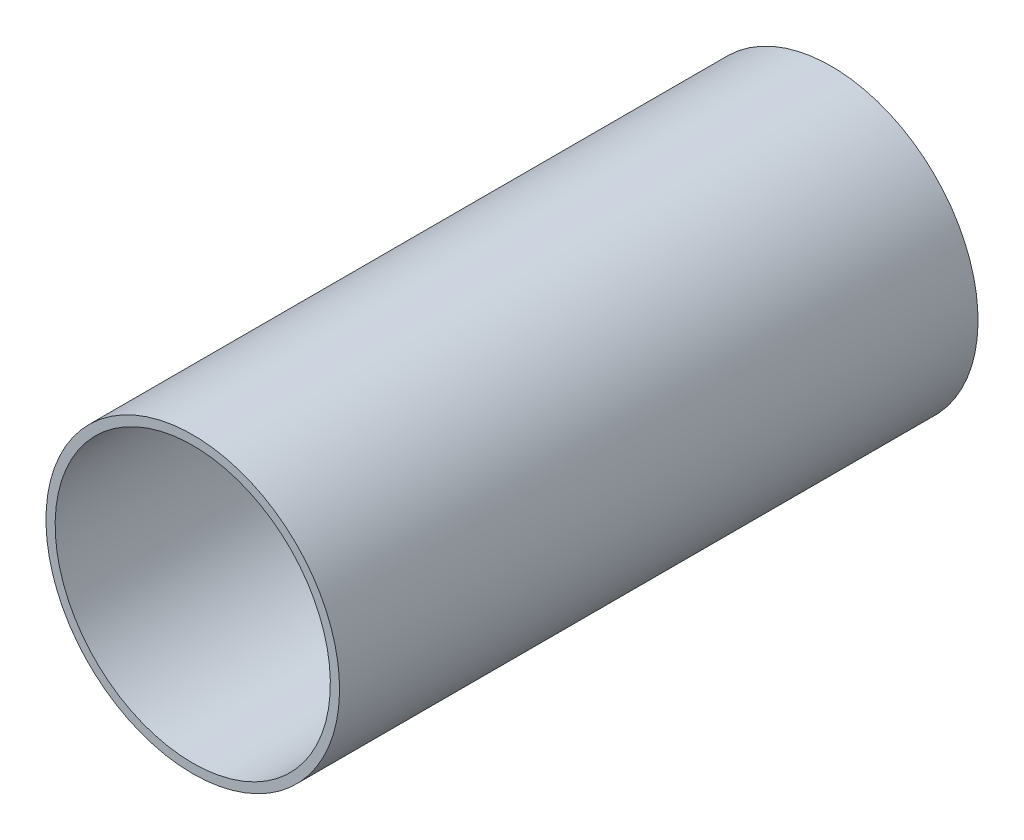
ISO-10303-21;
HEADER;
FILE_DESCRIPTION(('STEP AP214'),'2;1');
FILE_NAME('part.step','',(''),(''),'','','');
FILE_SCHEMA(('AUTOMOTIVE_DESIGN { 1 0 10303 214 1 1 1 1 }'));
ENDSEC;
DATA;
#1=APPLICATION_CONTEXT('core data for automotive mechanical design processes');
#2=APPLICATION_PROTOCOL_DEFINITION('international standard','automotive_design',2000,#1);
#3=PRODUCT_CONTEXT('',#1,'mechanical');
#4=PRODUCT('Part','Part','',(#3));
#5=PRODUCT_RELATED_PRODUCT_CATEGORY('part','',(#4));
#6=PRODUCT_DEFINITION_FORMATION('','',#4);
#7=PRODUCT_DEFINITION_CONTEXT('part definition',#1,'design');
#8=PRODUCT_DEFINITION('design','',#6,#7);
#9=PRODUCT_DEFINITION_SHAPE('','',#8);
#10=(LENGTH_UNIT() NAMED_UNIT(*) SI_UNIT(.MILLI.,.METRE.));
#11=(NAMED_UNIT(*) PLANE_ANGLE_UNIT() SI_UNIT($,.RADIAN.));
#12=(NAMED_UNIT(*) SI_UNIT($,.STERADIAN.) SOLID_ANGLE_UNIT());
#13=UNCERTAINTY_MEASURE_WITH_UNIT(LENGTH_MEASURE(1.E-05),#10,'distance_accuracy_value','');
#14=(GEOMETRIC_REPRESENTATION_CONTEXT(3) GLOBAL_UNCERTAINTY_ASSIGNED_CONTEXT((#13)) GLOBAL_UNIT_ASSIGNED_CONTEXT((#10,
#11,#12)) REPRESENTATION_CONTEXT('',''));
#15=CARTESIAN_POINT('',(0.,0.,0.));
#16=DIRECTION('',(0.,0.,1.));
#17=DIRECTION('',(1.,0.,0.));
#18=AXIS2_PLACEMENT_3D('',#15,#16,#17);
#19=CARTESIAN_POINT('',(160.02,-103.632,-0.045));
#20=DIRECTION('',(0.,0.,-1.));
#21=DIRECTION('',(0.,-1.,0.));
#22=AXIS2_PLACEMENT_3D('',#19,#20,#21);
#23=CYLINDRICAL_SURFACE('',#22,0.375);
#24=CARTESIAN_POINT('',(160.02,-103.632,-0.035));
#25=DIRECTION('',(0.,0.,-1.));
#26=DIRECTION('',(0.,-1.,0.));
#27=AXIS2_PLACEMENT_3D('',#24,#25,#26);
#28=CIRCLE('',#27,0.375);
#29=CARTESIAN_POINT('',(160.02,-104.007,-0.035));
#30=VERTEX_POINT('',#29);
#31=EDGE_CURVE('E64',#30,#30,#28,.T.);
#32=ORIENTED_EDGE('',*,*,#31,.T.);
#33=DIRECTION('',(0.,0.,1.));
#34=VECTOR('',#33,1.);
#35=CARTESIAN_POINT('',(160.02,-104.007,-0.045));
#36=LINE('',#35,#34);
#37=CARTESIAN_POINT('',(160.02,-104.007,1.705));
#38=VERTEX_POINT('',#37);
#39=EDGE_CURVE('E11',#30,#38,#36,.T.);
#40=ORIENTED_EDGE('',*,*,#39,.T.);
#41=CARTESIAN_POINT('',(160.02,-103.632,1.705));
#42=DIRECTION('',(0.,0.,-1.));
#43=DIRECTION('',(0.,-1.,0.));
#44=AXIS2_PLACEMENT_3D('',#41,#42,#43);
#45=CIRCLE('',#44,0.375);
#46=EDGE_CURVE('E25',#38,#38,#45,.T.);
#47=ORIENTED_EDGE('',*,*,#46,.F.);
#48=ORIENTED_EDGE('',*,*,#39,.F.);
#49=EDGE_LOOP('',(#32,#40,#47,#48));
#50=FACE_BOUND('',#49,.T.);
#51=ADVANCED_FACE('F17',(#50),#23,.F.);
#52=CARTESIAN_POINT('',(160.02,-104.032,1.705));
#53=DIRECTION('',(0.,0.,1.));
#54=DIRECTION('',(1.,0.,0.));
#55=AXIS2_PLACEMENT_3D('',#52,#53,#54);
#56=PLANE('',#55);
#57=ORIENTED_EDGE('',*,*,#46,.T.);
#58=EDGE_LOOP('',(#57));
#59=FACE_BOUND('',#58,.T.);
#60=CARTESIAN_POINT('',(160.02,-103.632,1.705));
#61=DIRECTION('',(0.,0.,1.));
#62=DIRECTION('',(0.,-1.,0.));
#63=AXIS2_PLACEMENT_3D('',#60,#61,#62);
#64=CIRCLE('',#63,0.4);
#65=CARTESIAN_POINT('',(160.02,-104.032,1.705));
#66=VERTEX_POINT('',#65);
#67=EDGE_CURVE('E56',#66,#66,#64,.T.);
#68=ORIENTED_EDGE('',*,*,#67,.T.);
#69=EDGE_LOOP('',(#68));
#70=FACE_BOUND('',#69,.T.);
#71=ADVANCED_FACE('F73',(#59,#70),#56,.T.);
#72=CARTESIAN_POINT('',(160.02,-104.032,-0.035));
#73=DIRECTION('',(0.,0.,1.));
#74=DIRECTION('',(1.,0.,0.));
#75=AXIS2_PLACEMENT_3D('',#72,#73,#74);
#76=PLANE('',#75);
#77=ORIENTED_EDGE('',*,*,#31,.F.);
#78=EDGE_LOOP('',(#77));
#79=FACE_BOUND('',#78,.T.);
#80=CARTESIAN_POINT('',(160.02,-103.632,-0.035));
#81=DIRECTION('',(0.,0.,1.));
#82=DIRECTION('',(0.,-1.,0.));
#83=AXIS2_PLACEMENT_3D('',#80,#81,#82);
#84=CIRCLE('',#83,0.4);
#85=CARTESIAN_POINT('',(160.02,-104.032,-0.035));
#86=VERTEX_POINT('',#85);
#87=EDGE_CURVE('E55',#86,#86,#84,.T.);
#88=ORIENTED_EDGE('',*,*,#87,.F.);
#89=EDGE_LOOP('',(#88));
#90=FACE_BOUND('',#89,.T.);
#91=ADVANCED_FACE('F82',(#79,#90),#76,.F.);
#92=CARTESIAN_POINT('',(160.02,-103.632,-0.035));
#93=DIRECTION('',(0.,0.,-1.));
#94=DIRECTION('',(0.,-1.,0.));
#95=AXIS2_PLACEMENT_3D('',#92,#93,#94);
#96=CYLINDRICAL_SURFACE('',#95,0.4);
#97=ORIENTED_EDGE('',*,*,#87,.T.);
#98=DIRECTION('',(0.,0.,1.));
#99=VECTOR('',#98,1.);
#100=CARTESIAN_POINT('',(160.02,-104.032,-0.035));
#101=LINE('',#100,#99);
#102=EDGE_CURVE('E52',#86,#66,#101,.T.);
#103=ORIENTED_EDGE('',*,*,#102,.T.);
#104=ORIENTED_EDGE('',*,*,#67,.F.);
#105=ORIENTED_EDGE('',*,*,#102,.F.);
#106=EDGE_LOOP('',(#97,#103,#104,#105));
#107=FACE_BOUND('',#106,.T.);
#108=ADVANCED_FACE('F53',(#107),#96,.T.);
#109=CLOSED_SHELL('',(#51,#71,#91,#108));
#110=MANIFOLD_SOLID_BREP('B1',#109);
#111=ADVANCED_BREP_SHAPE_REPRESENTATION('',(#18,#110),#14);
#112=SHAPE_DEFINITION_REPRESENTATION(#9,#111);
ENDSEC;
END-ISO-10303-21;
